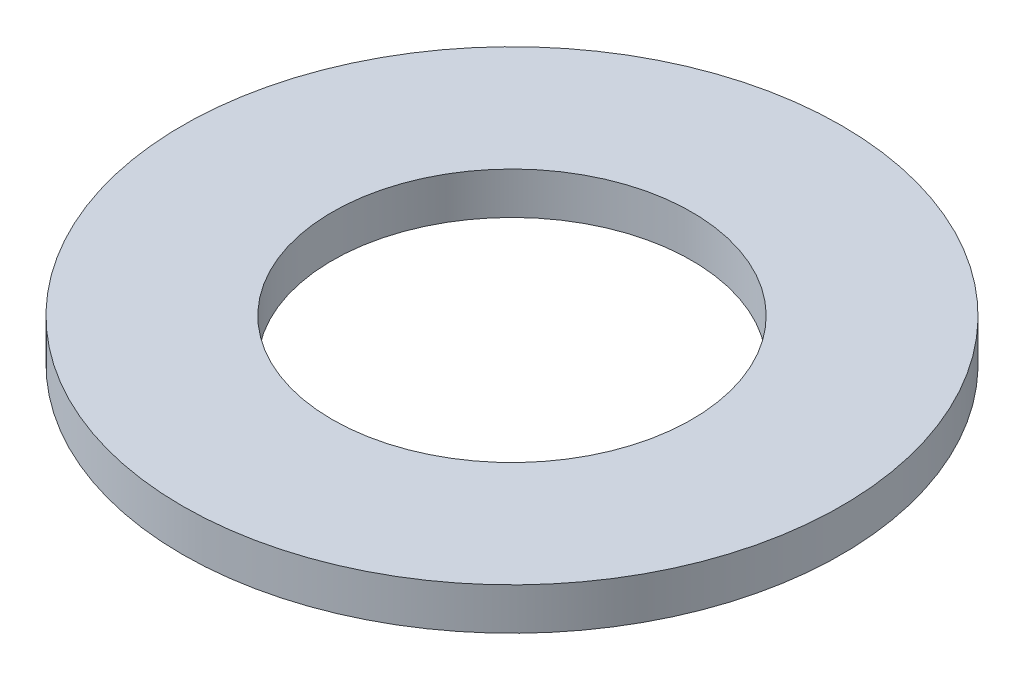
ISO-10303-21;
HEADER;
FILE_DESCRIPTION(('STEP AP214'),'2;1');
FILE_NAME('part.step','',(''),(''),'','','');
FILE_SCHEMA(('AUTOMOTIVE_DESIGN { 1 0 10303 214 1 1 1 1 }'));
ENDSEC;
DATA;
#1=APPLICATION_CONTEXT('core data for automotive mechanical design processes');
#2=APPLICATION_PROTOCOL_DEFINITION('international standard','automotive_design',2000,#1);
#3=PRODUCT_CONTEXT('',#1,'mechanical');
#4=PRODUCT('Part','Part','',(#3));
#5=PRODUCT_RELATED_PRODUCT_CATEGORY('part','',(#4));
#6=PRODUCT_DEFINITION_FORMATION('','',#4);
#7=PRODUCT_DEFINITION_CONTEXT('part definition',#1,'design');
#8=PRODUCT_DEFINITION('design','',#6,#7);
#9=PRODUCT_DEFINITION_SHAPE('','',#8);
#10=(LENGTH_UNIT() NAMED_UNIT(*) SI_UNIT(.MILLI.,.METRE.));
#11=(NAMED_UNIT(*) PLANE_ANGLE_UNIT() SI_UNIT($,.RADIAN.));
#12=(NAMED_UNIT(*) SI_UNIT($,.STERADIAN.) SOLID_ANGLE_UNIT());
#13=UNCERTAINTY_MEASURE_WITH_UNIT(LENGTH_MEASURE(1.E-05),#10,'distance_accuracy_value','');
#14=(GEOMETRIC_REPRESENTATION_CONTEXT(3) GLOBAL_UNCERTAINTY_ASSIGNED_CONTEXT((#13)) GLOBAL_UNIT_ASSIGNED_CONTEXT((#10,
#11,#12)) REPRESENTATION_CONTEXT('',''));
#15=CARTESIAN_POINT('',(0.,0.,0.));
#16=DIRECTION('',(0.,0.,1.));
#17=DIRECTION('',(1.,0.,0.));
#18=AXIS2_PLACEMENT_3D('',#15,#16,#17);
#19=CARTESIAN_POINT('',(0.,7.,0.));
#20=DIRECTION('',(0.,-1.,0.));
#21=DIRECTION('',(0.,0.,-1.));
#22=AXIS2_PLACEMENT_3D('',#19,#20,#21);
#23=CYLINDRICAL_SURFACE('',#22,55.);
#24=CARTESIAN_POINT('',(0.,7.,0.));
#25=DIRECTION('',(0.,1.,0.));
#26=DIRECTION('',(0.,0.,1.));
#27=AXIS2_PLACEMENT_3D('',#24,#25,#26);
#28=CIRCLE('',#27,55.);
#29=CARTESIAN_POINT('',(0.,7.,55.));
#30=VERTEX_POINT('',#29);
#31=EDGE_CURVE('E10',#30,#30,#28,.T.);
#32=ORIENTED_EDGE('',*,*,#31,.F.);
#33=EDGE_LOOP('',(#32));
#34=FACE_BOUND('',#33,.T.);
#35=CARTESIAN_POINT('',(0.,0.,0.));
#36=DIRECTION('',(0.,1.,0.));
#37=DIRECTION('',(0.,0.,1.));
#38=AXIS2_PLACEMENT_3D('',#35,#36,#37);
#39=CIRCLE('',#38,55.);
#40=CARTESIAN_POINT('',(0.,0.,55.));
#41=VERTEX_POINT('',#40);
#42=EDGE_CURVE('E37',#41,#41,#39,.T.);
#43=ORIENTED_EDGE('',*,*,#42,.T.);
#44=EDGE_LOOP('',(#43));
#45=FACE_BOUND('',#44,.T.);
#46=ADVANCED_FACE('F40',(#34,#45),#23,.T.);
#47=CARTESIAN_POINT('',(0.,7.,0.));
#48=DIRECTION('',(0.,1.,0.));
#49=DIRECTION('',(0.,0.,1.));
#50=AXIS2_PLACEMENT_3D('',#47,#48,#49);
#51=PLANE('',#50);
#52=CARTESIAN_POINT('',(0.,7.,0.));
#53=DIRECTION('',(0.,1.,0.));
#54=DIRECTION('',(0.,0.,1.));
#55=AXIS2_PLACEMENT_3D('',#52,#53,#54);
#56=CIRCLE('',#55,30.);
#57=CARTESIAN_POINT('',(0.,7.,30.));
#58=VERTEX_POINT('',#57);
#59=EDGE_CURVE('E50',#58,#58,#56,.T.);
#60=ORIENTED_EDGE('',*,*,#59,.F.);
#61=EDGE_LOOP('',(#60));
#62=FACE_BOUND('',#61,.T.);
#63=ORIENTED_EDGE('',*,*,#31,.T.);
#64=EDGE_LOOP('',(#63));
#65=FACE_BOUND('',#64,.T.);
#66=ADVANCED_FACE('F59',(#62,#65),#51,.T.);
#67=CARTESIAN_POINT('',(0.,0.,0.));
#68=DIRECTION('',(0.,1.,0.));
#69=DIRECTION('',(0.,0.,1.));
#70=AXIS2_PLACEMENT_3D('',#67,#68,#69);
#71=PLANE('',#70);
#72=CARTESIAN_POINT('',(0.,0.,0.));
#73=DIRECTION('',(0.,1.,0.));
#74=DIRECTION('',(0.,0.,1.));
#75=AXIS2_PLACEMENT_3D('',#72,#73,#74);
#76=CIRCLE('',#75,30.);
#77=CARTESIAN_POINT('',(0.,0.,30.));
#78=VERTEX_POINT('',#77);
#79=EDGE_CURVE('E47',#78,#78,#76,.T.);
#80=ORIENTED_EDGE('',*,*,#79,.T.);
#81=EDGE_LOOP('',(#80));
#82=FACE_BOUND('',#81,.T.);
#83=ORIENTED_EDGE('',*,*,#42,.F.);
#84=EDGE_LOOP('',(#83));
#85=FACE_BOUND('',#84,.T.);
#86=ADVANCED_FACE('F58',(#82,#85),#71,.F.);
#87=CARTESIAN_POINT('',(0.,7.,0.));
#88=DIRECTION('',(0.,-1.,0.));
#89=DIRECTION('',(0.,0.,-1.));
#90=AXIS2_PLACEMENT_3D('',#87,#88,#89);
#91=CYLINDRICAL_SURFACE('',#90,30.);
#92=ORIENTED_EDGE('',*,*,#59,.T.);
#93=EDGE_LOOP('',(#92));
#94=FACE_BOUND('',#93,.T.);
#95=ORIENTED_EDGE('',*,*,#79,.F.);
#96=EDGE_LOOP('',(#95));
#97=FACE_BOUND('',#96,.T.);
#98=ADVANCED_FACE('F54',(#94,#97),#91,.F.);
#99=CLOSED_SHELL('',(#46,#66,#86,#98));
#100=MANIFOLD_SOLID_BREP('B2',#99);
#101=ADVANCED_BREP_SHAPE_REPRESENTATION('',(#18,#100),#14);
#102=SHAPE_DEFINITION_REPRESENTATION(#9,#101);
ENDSEC;
END-ISO-10303-21;
